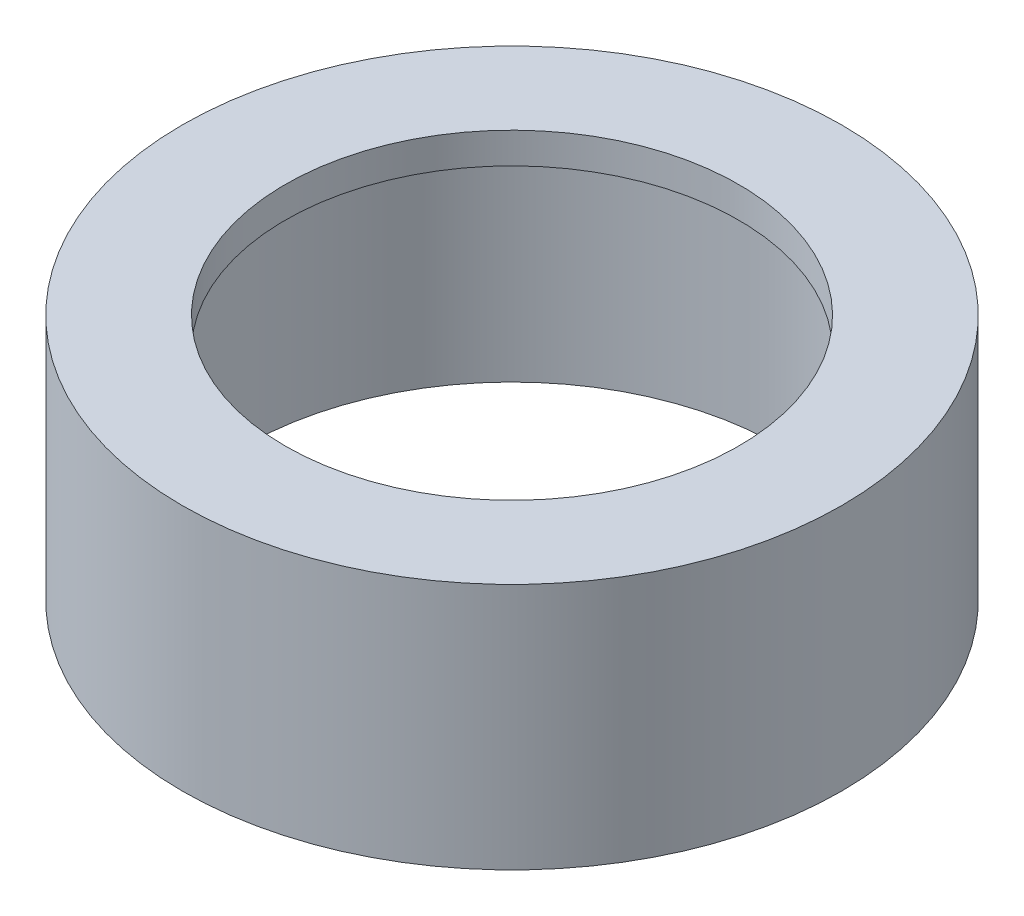
ISO-10303-21;
HEADER;
FILE_DESCRIPTION(('STEP AP214'),'2;1');
FILE_NAME('part.step','',(''),(''),'','','');
FILE_SCHEMA(('AUTOMOTIVE_DESIGN { 1 0 10303 214 1 1 1 1 }'));
ENDSEC;
DATA;
#1=APPLICATION_CONTEXT('core data for automotive mechanical design processes');
#2=APPLICATION_PROTOCOL_DEFINITION('international standard','automotive_design',2000,#1);
#3=PRODUCT_CONTEXT('',#1,'mechanical');
#4=PRODUCT('Part','Part','',(#3));
#5=PRODUCT_RELATED_PRODUCT_CATEGORY('part','',(#4));
#6=PRODUCT_DEFINITION_FORMATION('','',#4);
#7=PRODUCT_DEFINITION_CONTEXT('part definition',#1,'design');
#8=PRODUCT_DEFINITION('design','',#6,#7);
#9=PRODUCT_DEFINITION_SHAPE('','',#8);
#10=(LENGTH_UNIT() NAMED_UNIT(*) SI_UNIT(.MILLI.,.METRE.));
#11=(NAMED_UNIT(*) PLANE_ANGLE_UNIT() SI_UNIT($,.RADIAN.));
#12=(NAMED_UNIT(*) SI_UNIT($,.STERADIAN.) SOLID_ANGLE_UNIT());
#13=UNCERTAINTY_MEASURE_WITH_UNIT(LENGTH_MEASURE(1.E-05),#10,'distance_accuracy_value','');
#14=(GEOMETRIC_REPRESENTATION_CONTEXT(3) GLOBAL_UNCERTAINTY_ASSIGNED_CONTEXT((#13)) GLOBAL_UNIT_ASSIGNED_CONTEXT((#10,
#11,#12)) REPRESENTATION_CONTEXT('',''));
#15=CARTESIAN_POINT('',(0.,0.,0.));
#16=DIRECTION('',(0.,0.,1.));
#17=DIRECTION('',(1.,0.,0.));
#18=AXIS2_PLACEMENT_3D('',#15,#16,#17);
#19=CARTESIAN_POINT('',(0.,12.,0.));
#20=DIRECTION('',(0.,-1.,0.));
#21=DIRECTION('',(0.,0.,-1.));
#22=AXIS2_PLACEMENT_3D('',#19,#20,#21);
#23=CYLINDRICAL_SURFACE('',#22,13.);
#24=CARTESIAN_POINT('',(0.,0.,0.));
#25=DIRECTION('',(0.,1.,0.));
#26=DIRECTION('',(0.,0.,1.));
#27=AXIS2_PLACEMENT_3D('',#24,#25,#26);
#28=CIRCLE('',#27,13.);
#29=CARTESIAN_POINT('',(0.,0.,13.));
#30=VERTEX_POINT('',#29);
#31=EDGE_CURVE('E45',#30,#30,#28,.T.);
#32=ORIENTED_EDGE('',*,*,#31,.F.);
#33=EDGE_LOOP('',(#32));
#34=FACE_BOUND('',#33,.T.);
#35=CARTESIAN_POINT('',(0.,10.5,0.));
#36=DIRECTION('',(0.,1.,0.));
#37=DIRECTION('',(0.,0.,1.));
#38=AXIS2_PLACEMENT_3D('',#35,#36,#37);
#39=CIRCLE('',#38,13.);
#40=CARTESIAN_POINT('',(0.,10.5,13.));
#41=VERTEX_POINT('',#40);
#42=EDGE_CURVE('E49',#41,#41,#39,.T.);
#43=ORIENTED_EDGE('',*,*,#42,.T.);
#44=EDGE_LOOP('',(#43));
#45=FACE_BOUND('',#44,.T.);
#46=ADVANCED_FACE('F34',(#34,#45),#23,.F.);
#47=CARTESIAN_POINT('',(0.,12.,0.));
#48=DIRECTION('',(0.,1.,0.));
#49=DIRECTION('',(0.,0.,1.));
#50=AXIS2_PLACEMENT_3D('',#47,#48,#49);
#51=PLANE('',#50);
#52=CARTESIAN_POINT('',(0.,12.,0.));
#53=DIRECTION('',(0.,1.,0.));
#54=DIRECTION('',(0.,0.,1.));
#55=AXIS2_PLACEMENT_3D('',#52,#53,#54);
#56=CIRCLE('',#55,16.);
#57=CARTESIAN_POINT('',(0.,12.,16.));
#58=VERTEX_POINT('',#57);
#59=EDGE_CURVE('E10',#58,#58,#56,.T.);
#60=ORIENTED_EDGE('',*,*,#59,.T.);
#61=EDGE_LOOP('',(#60));
#62=FACE_BOUND('',#61,.T.);
#63=CARTESIAN_POINT('',(0.,12.,0.));
#64=DIRECTION('',(0.,1.,0.));
#65=DIRECTION('',(0.,0.,1.));
#66=AXIS2_PLACEMENT_3D('',#63,#64,#65);
#67=CIRCLE('',#66,11.);
#68=CARTESIAN_POINT('',(0.,12.,11.));
#69=VERTEX_POINT('',#68);
#70=EDGE_CURVE('E53',#69,#69,#67,.T.);
#71=ORIENTED_EDGE('',*,*,#70,.F.);
#72=EDGE_LOOP('',(#71));
#73=FACE_BOUND('',#72,.T.);
#74=ADVANCED_FACE('F68',(#62,#73),#51,.T.);
#75=CARTESIAN_POINT('',(0.,0.,0.));
#76=DIRECTION('',(0.,1.,0.));
#77=DIRECTION('',(0.,0.,1.));
#78=AXIS2_PLACEMENT_3D('',#75,#76,#77);
#79=PLANE('',#78);
#80=CARTESIAN_POINT('',(0.,0.,0.));
#81=DIRECTION('',(0.,1.,0.));
#82=DIRECTION('',(0.,0.,1.));
#83=AXIS2_PLACEMENT_3D('',#80,#81,#82);
#84=CIRCLE('',#83,16.);
#85=CARTESIAN_POINT('',(0.,0.,16.));
#86=VERTEX_POINT('',#85);
#87=EDGE_CURVE('E38',#86,#86,#84,.T.);
#88=ORIENTED_EDGE('',*,*,#87,.F.);
#89=EDGE_LOOP('',(#88));
#90=FACE_BOUND('',#89,.T.);
#91=ORIENTED_EDGE('',*,*,#31,.T.);
#92=EDGE_LOOP('',(#91));
#93=FACE_BOUND('',#92,.T.);
#94=ADVANCED_FACE('F70',(#90,#93),#79,.F.);
#95=CARTESIAN_POINT('',(0.,12.,0.));
#96=DIRECTION('',(0.,-1.,0.));
#97=DIRECTION('',(0.,0.,-1.));
#98=AXIS2_PLACEMENT_3D('',#95,#96,#97);
#99=CYLINDRICAL_SURFACE('',#98,16.);
#100=ORIENTED_EDGE('',*,*,#59,.F.);
#101=EDGE_LOOP('',(#100));
#102=FACE_BOUND('',#101,.T.);
#103=ORIENTED_EDGE('',*,*,#87,.T.);
#104=EDGE_LOOP('',(#103));
#105=FACE_BOUND('',#104,.T.);
#106=ADVANCED_FACE('F36',(#102,#105),#99,.T.);
#107=CARTESIAN_POINT('',(0.,10.5,0.));
#108=DIRECTION('',(0.,1.,0.));
#109=DIRECTION('',(0.,0.,1.));
#110=AXIS2_PLACEMENT_3D('',#107,#108,#109);
#111=PLANE('',#110);
#112=CARTESIAN_POINT('',(0.,10.5,0.));
#113=DIRECTION('',(0.,1.,0.));
#114=DIRECTION('',(0.,0.,1.));
#115=AXIS2_PLACEMENT_3D('',#112,#113,#114);
#116=CIRCLE('',#115,11.);
#117=CARTESIAN_POINT('',(0.,10.5,11.));
#118=VERTEX_POINT('',#117);
#119=EDGE_CURVE('E52',#118,#118,#116,.T.);
#120=ORIENTED_EDGE('',*,*,#119,.T.);
#121=EDGE_LOOP('',(#120));
#122=FACE_BOUND('',#121,.T.);
#123=ORIENTED_EDGE('',*,*,#42,.F.);
#124=EDGE_LOOP('',(#123));
#125=FACE_BOUND('',#124,.T.);
#126=ADVANCED_FACE('F59',(#122,#125),#111,.F.);
#127=CARTESIAN_POINT('',(0.,10.5,0.));
#128=DIRECTION('',(0.,1.,0.));
#129=DIRECTION('',(0.,0.,1.));
#130=AXIS2_PLACEMENT_3D('',#127,#128,#129);
#131=CYLINDRICAL_SURFACE('',#130,11.);
#132=ORIENTED_EDGE('',*,*,#119,.F.);
#133=EDGE_LOOP('',(#132));
#134=FACE_BOUND('',#133,.T.);
#135=ORIENTED_EDGE('',*,*,#70,.T.);
#136=EDGE_LOOP('',(#135));
#137=FACE_BOUND('',#136,.T.);
#138=ADVANCED_FACE('F62',(#134,#137),#131,.F.);
#139=CLOSED_SHELL('',(#46,#74,#94,#106,#126,#138));
#140=MANIFOLD_SOLID_BREP('B2',#139);
#141=ADVANCED_BREP_SHAPE_REPRESENTATION('',(#18,#140),#14);
#142=SHAPE_DEFINITION_REPRESENTATION(#9,#141);
ENDSEC;
END-ISO-10303-21;
